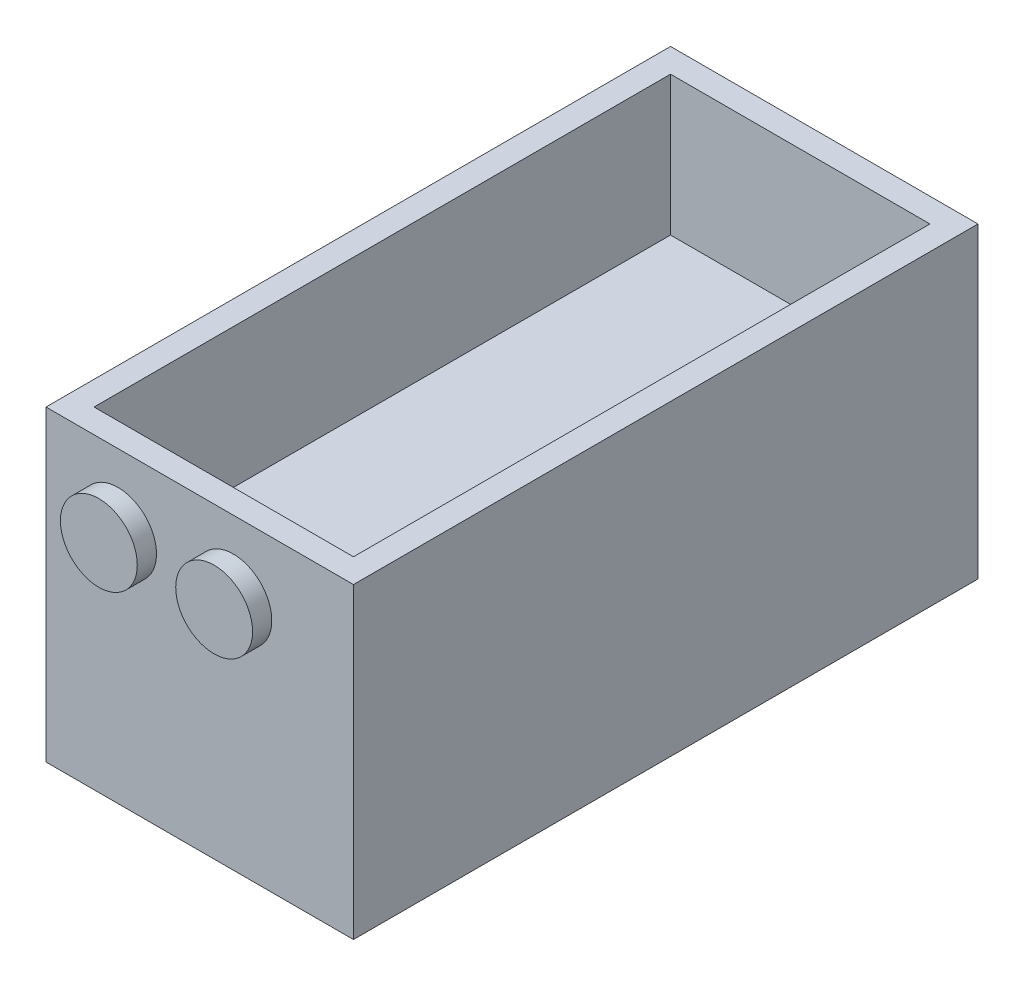
ISO-10303-21;
HEADER;
FILE_DESCRIPTION(('STEP AP214'),'2;1');
FILE_NAME('part.step','',(''),(''),'','','');
FILE_SCHEMA(('AUTOMOTIVE_DESIGN { 1 0 10303 214 1 1 1 1 }'));
ENDSEC;
DATA;
#1=APPLICATION_CONTEXT('core data for automotive mechanical design processes');
#2=APPLICATION_PROTOCOL_DEFINITION('international standard','automotive_design',2000,#1);
#3=PRODUCT_CONTEXT('',#1,'mechanical');
#4=PRODUCT('Part','Part','',(#3));
#5=PRODUCT_RELATED_PRODUCT_CATEGORY('part','',(#4));
#6=PRODUCT_DEFINITION_FORMATION('','',#4);
#7=PRODUCT_DEFINITION_CONTEXT('part definition',#1,'design');
#8=PRODUCT_DEFINITION('design','',#6,#7);
#9=PRODUCT_DEFINITION_SHAPE('','',#8);
#10=(LENGTH_UNIT() NAMED_UNIT(*) SI_UNIT(.MILLI.,.METRE.));
#11=(NAMED_UNIT(*) PLANE_ANGLE_UNIT() SI_UNIT($,.RADIAN.));
#12=(NAMED_UNIT(*) SI_UNIT($,.STERADIAN.) SOLID_ANGLE_UNIT());
#13=UNCERTAINTY_MEASURE_WITH_UNIT(LENGTH_MEASURE(1.E-05),#10,'distance_accuracy_value','');
#14=(GEOMETRIC_REPRESENTATION_CONTEXT(3) GLOBAL_UNCERTAINTY_ASSIGNED_CONTEXT((#13)) GLOBAL_UNIT_ASSIGNED_CONTEXT((#10,
#11,#12)) REPRESENTATION_CONTEXT('',''));
#15=CARTESIAN_POINT('',(0.,0.,0.));
#16=DIRECTION('',(0.,0.,1.));
#17=DIRECTION('',(1.,0.,0.));
#18=AXIS2_PLACEMENT_3D('',#15,#16,#17);
#19=CARTESIAN_POINT('',(0.,32.,0.));
#20=DIRECTION('',(1.,0.,0.));
#21=DIRECTION('',(0.,0.,-1.));
#22=AXIS2_PLACEMENT_3D('',#19,#20,#21);
#23=PLANE('',#22);
#24=DIRECTION('',(0.,0.,1.));
#25=VECTOR('',#24,1.);
#26=CARTESIAN_POINT('',(0.,0.,0.));
#27=LINE('',#26,#25);
#28=CARTESIAN_POINT('',(0.,0.,0.));
#29=VERTEX_POINT('',#28);
#30=CARTESIAN_POINT('',(0.,0.,65.));
#31=VERTEX_POINT('',#30);
#32=EDGE_CURVE('E171',#29,#31,#27,.T.);
#33=ORIENTED_EDGE('',*,*,#32,.T.);
#34=DIRECTION('',(0.,-1.,0.));
#35=VECTOR('',#34,1.);
#36=CARTESIAN_POINT('',(0.,32.,65.));
#37=LINE('',#36,#35);
#38=CARTESIAN_POINT('',(0.,32.,65.));
#39=VERTEX_POINT('',#38);
#40=EDGE_CURVE('E218',#39,#31,#37,.T.);
#41=ORIENTED_EDGE('',*,*,#40,.F.);
#42=DIRECTION('',(0.,0.,1.));
#43=VECTOR('',#42,1.);
#44=CARTESIAN_POINT('',(0.,32.,0.));
#45=LINE('',#44,#43);
#46=CARTESIAN_POINT('',(0.,32.,0.));
#47=VERTEX_POINT('',#46);
#48=EDGE_CURVE('E192',#47,#39,#45,.T.);
#49=ORIENTED_EDGE('',*,*,#48,.F.);
#50=DIRECTION('',(0.,-1.,0.));
#51=VECTOR('',#50,1.);
#52=CARTESIAN_POINT('',(0.,32.,0.));
#53=LINE('',#52,#51);
#54=EDGE_CURVE('E202',#47,#29,#53,.T.);
#55=ORIENTED_EDGE('',*,*,#54,.T.);
#56=EDGE_LOOP('',(#33,#41,#49,#55));
#57=FACE_BOUND('',#56,.T.);
#58=ADVANCED_FACE('F35',(#57),#23,.F.);
#59=CARTESIAN_POINT('',(0.,32.,65.));
#60=DIRECTION('',(0.,0.,-1.));
#61=DIRECTION('',(-1.,0.,0.));
#62=AXIS2_PLACEMENT_3D('',#59,#60,#61);
#63=PLANE('',#62);
#64=CARTESIAN_POINT('',(19.5,24.5,65.));
#65=DIRECTION('',(0.,0.,-1.));
#66=DIRECTION('',(-1.,0.,0.));
#67=AXIS2_PLACEMENT_3D('',#64,#65,#66);
#68=CIRCLE('',#67,4.);
#69=CARTESIAN_POINT('',(15.5,24.5,65.));
#70=VERTEX_POINT('',#69);
#71=EDGE_CURVE('E11',#70,#70,#68,.F.);
#72=ORIENTED_EDGE('',*,*,#71,.F.);
#73=EDGE_LOOP('',(#72));
#74=FACE_BOUND('',#73,.T.);
#75=CARTESIAN_POINT('',(7.50000000000002,24.5,65.));
#76=DIRECTION('',(0.,0.,-1.));
#77=DIRECTION('',(-1.,0.,0.));
#78=AXIS2_PLACEMENT_3D('',#75,#76,#77);
#79=CIRCLE('',#78,4.);
#80=CARTESIAN_POINT('',(3.50000000000002,24.5,65.));
#81=VERTEX_POINT('',#80);
#82=EDGE_CURVE('E42',#81,#81,#79,.F.);
#83=ORIENTED_EDGE('',*,*,#82,.F.);
#84=EDGE_LOOP('',(#83));
#85=FACE_BOUND('',#84,.T.);
#86=DIRECTION('',(1.,0.,0.));
#87=VECTOR('',#86,1.);
#88=CARTESIAN_POINT('',(0.,0.,65.));
#89=LINE('',#88,#87);
#90=CARTESIAN_POINT('',(32.,0.,65.));
#91=VERTEX_POINT('',#90);
#92=EDGE_CURVE('E205',#31,#91,#89,.T.);
#93=ORIENTED_EDGE('',*,*,#92,.T.);
#94=DIRECTION('',(0.,-1.,0.));
#95=VECTOR('',#94,1.);
#96=CARTESIAN_POINT('',(32.,32.,65.));
#97=LINE('',#96,#95);
#98=CARTESIAN_POINT('',(32.,32.,65.));
#99=VERTEX_POINT('',#98);
#100=EDGE_CURVE('E215',#99,#91,#97,.T.);
#101=ORIENTED_EDGE('',*,*,#100,.F.);
#102=DIRECTION('',(1.,0.,0.));
#103=VECTOR('',#102,1.);
#104=CARTESIAN_POINT('',(0.,32.,65.));
#105=LINE('',#104,#103);
#106=EDGE_CURVE('E195',#39,#99,#105,.T.);
#107=ORIENTED_EDGE('',*,*,#106,.F.);
#108=ORIENTED_EDGE('',*,*,#40,.T.);
#109=EDGE_LOOP('',(#93,#101,#107,#108));
#110=FACE_BOUND('',#109,.T.);
#111=ADVANCED_FACE('F225',(#74,#85,#110),#63,.F.);
#112=CARTESIAN_POINT('',(32.,32.,0.));
#113=DIRECTION('',(-1.,0.,0.));
#114=DIRECTION('',(0.,0.,1.));
#115=AXIS2_PLACEMENT_3D('',#112,#113,#114);
#116=PLANE('',#115);
#117=DIRECTION('',(0.,0.,-1.));
#118=VECTOR('',#117,1.);
#119=CARTESIAN_POINT('',(32.,0.,0.));
#120=LINE('',#119,#118);
#121=CARTESIAN_POINT('',(32.,0.,0.));
#122=VERTEX_POINT('',#121);
#123=EDGE_CURVE('E207',#91,#122,#120,.T.);
#124=ORIENTED_EDGE('',*,*,#123,.T.);
#125=DIRECTION('',(0.,-1.,0.));
#126=VECTOR('',#125,1.);
#127=CARTESIAN_POINT('',(32.,32.,0.));
#128=LINE('',#127,#126);
#129=CARTESIAN_POINT('',(32.,32.,0.));
#130=VERTEX_POINT('',#129);
#131=EDGE_CURVE('E212',#130,#122,#128,.T.);
#132=ORIENTED_EDGE('',*,*,#131,.F.);
#133=DIRECTION('',(0.,0.,-1.));
#134=VECTOR('',#133,1.);
#135=CARTESIAN_POINT('',(32.,32.,0.));
#136=LINE('',#135,#134);
#137=EDGE_CURVE('E198',#99,#130,#136,.T.);
#138=ORIENTED_EDGE('',*,*,#137,.F.);
#139=ORIENTED_EDGE('',*,*,#100,.T.);
#140=EDGE_LOOP('',(#124,#132,#138,#139));
#141=FACE_BOUND('',#140,.T.);
#142=ADVANCED_FACE('F228',(#141),#116,.F.);
#143=CARTESIAN_POINT('',(0.,32.,0.));
#144=DIRECTION('',(0.,0.,1.));
#145=DIRECTION('',(1.,0.,0.));
#146=AXIS2_PLACEMENT_3D('',#143,#144,#145);
#147=PLANE('',#146);
#148=DIRECTION('',(-1.,0.,0.));
#149=VECTOR('',#148,1.);
#150=CARTESIAN_POINT('',(0.,0.,0.));
#151=LINE('',#150,#149);
#152=EDGE_CURVE('E196',#122,#29,#151,.T.);
#153=ORIENTED_EDGE('',*,*,#152,.T.);
#154=ORIENTED_EDGE('',*,*,#54,.F.);
#155=DIRECTION('',(-1.,0.,0.));
#156=VECTOR('',#155,1.);
#157=CARTESIAN_POINT('',(0.,32.,0.));
#158=LINE('',#157,#156);
#159=EDGE_CURVE('E200',#130,#47,#158,.T.);
#160=ORIENTED_EDGE('',*,*,#159,.F.);
#161=ORIENTED_EDGE('',*,*,#131,.T.);
#162=EDGE_LOOP('',(#153,#154,#160,#161));
#163=FACE_BOUND('',#162,.T.);
#164=ADVANCED_FACE('F240',(#163),#147,.F.);
#165=CARTESIAN_POINT('',(0.,32.,0.));
#166=DIRECTION('',(0.,1.,0.));
#167=DIRECTION('',(0.,0.,1.));
#168=AXIS2_PLACEMENT_3D('',#165,#166,#167);
#169=PLANE('',#168);
#170=DIRECTION('',(0.,0.,1.));
#171=VECTOR('',#170,1.);
#172=CARTESIAN_POINT('',(2.5,32.,0.));
#173=LINE('',#172,#171);
#174=CARTESIAN_POINT('',(2.5,32.,2.5));
#175=VERTEX_POINT('',#174);
#176=CARTESIAN_POINT('',(2.50000000000002,32.,62.5));
#177=VERTEX_POINT('',#176);
#178=EDGE_CURVE('E185',#175,#177,#173,.T.);
#179=ORIENTED_EDGE('',*,*,#178,.F.);
#180=DIRECTION('',(-1.,0.,0.));
#181=VECTOR('',#180,1.);
#182=CARTESIAN_POINT('',(0.,32.,2.5));
#183=LINE('',#182,#181);
#184=CARTESIAN_POINT('',(29.5,32.,2.5));
#185=VERTEX_POINT('',#184);
#186=EDGE_CURVE('E176',#185,#175,#183,.T.);
#187=ORIENTED_EDGE('',*,*,#186,.F.);
#188=DIRECTION('',(0.,0.,-1.));
#189=VECTOR('',#188,1.);
#190=CARTESIAN_POINT('',(29.5,32.,0.));
#191=LINE('',#190,#189);
#192=CARTESIAN_POINT('',(29.5,32.,62.5));
#193=VERTEX_POINT('',#192);
#194=EDGE_CURVE('E189',#193,#185,#191,.T.);
#195=ORIENTED_EDGE('',*,*,#194,.F.);
#196=DIRECTION('',(1.,0.,0.));
#197=VECTOR('',#196,1.);
#198=CARTESIAN_POINT('',(0.,32.,62.5));
#199=LINE('',#198,#197);
#200=EDGE_CURVE('E187',#177,#193,#199,.T.);
#201=ORIENTED_EDGE('',*,*,#200,.F.);
#202=EDGE_LOOP('',(#179,#187,#195,#201));
#203=FACE_BOUND('',#202,.T.);
#204=ORIENTED_EDGE('',*,*,#48,.T.);
#205=ORIENTED_EDGE('',*,*,#106,.T.);
#206=ORIENTED_EDGE('',*,*,#137,.T.);
#207=ORIENTED_EDGE('',*,*,#159,.T.);
#208=EDGE_LOOP('',(#204,#205,#206,#207));
#209=FACE_BOUND('',#208,.T.);
#210=ADVANCED_FACE('F245',(#203,#209),#169,.T.);
#211=CARTESIAN_POINT('',(0.,0.,0.));
#212=DIRECTION('',(0.,1.,0.));
#213=DIRECTION('',(0.,0.,1.));
#214=AXIS2_PLACEMENT_3D('',#211,#212,#213);
#215=PLANE('',#214);
#216=DIRECTION('',(-1.,0.,0.));
#217=VECTOR('',#216,1.);
#218=CARTESIAN_POINT('',(0.,0.,2.5));
#219=LINE('',#218,#217);
#220=CARTESIAN_POINT('',(29.5,0.,2.5));
#221=VERTEX_POINT('',#220);
#222=CARTESIAN_POINT('',(2.5,0.,2.5));
#223=VERTEX_POINT('',#222);
#224=EDGE_CURVE('E130',#221,#223,#219,.T.);
#225=ORIENTED_EDGE('',*,*,#224,.T.);
#226=DIRECTION('',(0.,0.,1.));
#227=VECTOR('',#226,1.);
#228=CARTESIAN_POINT('',(2.5,0.,0.));
#229=LINE('',#228,#227);
#230=CARTESIAN_POINT('',(2.50000000000002,0.,62.5));
#231=VERTEX_POINT('',#230);
#232=EDGE_CURVE('E138',#223,#231,#229,.T.);
#233=ORIENTED_EDGE('',*,*,#232,.T.);
#234=DIRECTION('',(1.,0.,0.));
#235=VECTOR('',#234,1.);
#236=CARTESIAN_POINT('',(0.,0.,62.5));
#237=LINE('',#236,#235);
#238=CARTESIAN_POINT('',(29.5,0.,62.5));
#239=VERTEX_POINT('',#238);
#240=EDGE_CURVE('E145',#231,#239,#237,.T.);
#241=ORIENTED_EDGE('',*,*,#240,.T.);
#242=DIRECTION('',(0.,0.,-1.));
#243=VECTOR('',#242,1.);
#244=CARTESIAN_POINT('',(29.5,0.,0.));
#245=LINE('',#244,#243);
#246=EDGE_CURVE('E49',#239,#221,#245,.T.);
#247=ORIENTED_EDGE('',*,*,#246,.T.);
#248=EDGE_LOOP('',(#225,#233,#241,#247));
#249=FACE_BOUND('',#248,.T.);
#250=ORIENTED_EDGE('',*,*,#32,.F.);
#251=ORIENTED_EDGE('',*,*,#152,.F.);
#252=ORIENTED_EDGE('',*,*,#123,.F.);
#253=ORIENTED_EDGE('',*,*,#92,.F.);
#254=EDGE_LOOP('',(#250,#251,#252,#253));
#255=FACE_BOUND('',#254,.T.);
#256=ADVANCED_FACE('F148',(#249,#255),#215,.F.);
#257=CARTESIAN_POINT('',(2.5,32.,0.));
#258=DIRECTION('',(1.,0.,0.));
#259=DIRECTION('',(0.,0.,-1.));
#260=AXIS2_PLACEMENT_3D('',#257,#258,#259);
#261=PLANE('',#260);
#262=DIRECTION('',(0.,0.,1.));
#263=VECTOR('',#262,1.);
#264=CARTESIAN_POINT('',(2.5,17.5,0.));
#265=LINE('',#264,#263);
#266=CARTESIAN_POINT('',(2.5,17.5,2.5));
#267=VERTEX_POINT('',#266);
#268=CARTESIAN_POINT('',(2.50000000000002,17.5,62.5));
#269=VERTEX_POINT('',#268);
#270=EDGE_CURVE('E164',#267,#269,#265,.T.);
#271=ORIENTED_EDGE('',*,*,#270,.F.);
#272=DIRECTION('',(0.,-1.,0.));
#273=VECTOR('',#272,1.);
#274=CARTESIAN_POINT('',(2.5,32.,2.5));
#275=LINE('',#274,#273);
#276=EDGE_CURVE('E173',#175,#267,#275,.T.);
#277=ORIENTED_EDGE('',*,*,#276,.F.);
#278=ORIENTED_EDGE('',*,*,#178,.T.);
#279=DIRECTION('',(0.,-1.,0.));
#280=VECTOR('',#279,1.);
#281=CARTESIAN_POINT('',(2.50000000000002,32.,62.5));
#282=LINE('',#281,#280);
#283=EDGE_CURVE('E168',#177,#269,#282,.T.);
#284=ORIENTED_EDGE('',*,*,#283,.T.);
#285=EDGE_LOOP('',(#271,#277,#278,#284));
#286=FACE_BOUND('',#285,.T.);
#287=ADVANCED_FACE('F253',(#286),#261,.T.);
#288=CARTESIAN_POINT('',(0.,32.,62.5));
#289=DIRECTION('',(0.,0.,-1.));
#290=DIRECTION('',(-1.,0.,0.));
#291=AXIS2_PLACEMENT_3D('',#288,#289,#290);
#292=PLANE('',#291);
#293=DIRECTION('',(1.,0.,0.));
#294=VECTOR('',#293,1.);
#295=CARTESIAN_POINT('',(0.,17.5,62.5));
#296=LINE('',#295,#294);
#297=CARTESIAN_POINT('',(29.5,17.5,62.5));
#298=VERTEX_POINT('',#297);
#299=EDGE_CURVE('E167',#269,#298,#296,.T.);
#300=ORIENTED_EDGE('',*,*,#299,.F.);
#301=ORIENTED_EDGE('',*,*,#283,.F.);
#302=ORIENTED_EDGE('',*,*,#200,.T.);
#303=DIRECTION('',(0.,-1.,0.));
#304=VECTOR('',#303,1.);
#305=CARTESIAN_POINT('',(29.5,32.,62.5));
#306=LINE('',#305,#304);
#307=EDGE_CURVE('E172',#193,#298,#306,.T.);
#308=ORIENTED_EDGE('',*,*,#307,.T.);
#309=EDGE_LOOP('',(#300,#301,#302,#308));
#310=FACE_BOUND('',#309,.T.);
#311=ADVANCED_FACE('F293',(#310),#292,.T.);
#312=CARTESIAN_POINT('',(29.5,32.,0.));
#313=DIRECTION('',(-1.,0.,0.));
#314=DIRECTION('',(0.,0.,1.));
#315=AXIS2_PLACEMENT_3D('',#312,#313,#314);
#316=PLANE('',#315);
#317=DIRECTION('',(0.,0.,-1.));
#318=VECTOR('',#317,1.);
#319=CARTESIAN_POINT('',(29.5,17.5,0.));
#320=LINE('',#319,#318);
#321=CARTESIAN_POINT('',(29.5,17.5,2.5));
#322=VERTEX_POINT('',#321);
#323=EDGE_CURVE('E178',#298,#322,#320,.T.);
#324=ORIENTED_EDGE('',*,*,#323,.F.);
#325=ORIENTED_EDGE('',*,*,#307,.F.);
#326=ORIENTED_EDGE('',*,*,#194,.T.);
#327=DIRECTION('',(0.,-1.,0.));
#328=VECTOR('',#327,1.);
#329=CARTESIAN_POINT('',(29.5,32.,2.5));
#330=LINE('',#329,#328);
#331=EDGE_CURVE('E57',#185,#322,#330,.T.);
#332=ORIENTED_EDGE('',*,*,#331,.T.);
#333=EDGE_LOOP('',(#324,#325,#326,#332));
#334=FACE_BOUND('',#333,.T.);
#335=ADVANCED_FACE('F305',(#334),#316,.T.);
#336=CARTESIAN_POINT('',(0.,32.,2.5));
#337=DIRECTION('',(0.,0.,1.));
#338=DIRECTION('',(1.,0.,0.));
#339=AXIS2_PLACEMENT_3D('',#336,#337,#338);
#340=PLANE('',#339);
#341=DIRECTION('',(-1.,0.,0.));
#342=VECTOR('',#341,1.);
#343=CARTESIAN_POINT('',(0.,17.5,2.5));
#344=LINE('',#343,#342);
#345=EDGE_CURVE('E182',#322,#267,#344,.T.);
#346=ORIENTED_EDGE('',*,*,#345,.F.);
#347=ORIENTED_EDGE('',*,*,#331,.F.);
#348=ORIENTED_EDGE('',*,*,#186,.T.);
#349=ORIENTED_EDGE('',*,*,#276,.T.);
#350=EDGE_LOOP('',(#346,#347,#348,#349));
#351=FACE_BOUND('',#350,.T.);
#352=ADVANCED_FACE('F315',(#351),#340,.T.);
#353=CARTESIAN_POINT('',(0.,17.5,0.));
#354=DIRECTION('',(0.,1.,0.));
#355=DIRECTION('',(0.,0.,1.));
#356=AXIS2_PLACEMENT_3D('',#353,#354,#355);
#357=PLANE('',#356);
#358=ORIENTED_EDGE('',*,*,#270,.T.);
#359=ORIENTED_EDGE('',*,*,#299,.T.);
#360=ORIENTED_EDGE('',*,*,#323,.T.);
#361=ORIENTED_EDGE('',*,*,#345,.T.);
#362=EDGE_LOOP('',(#358,#359,#360,#361));
#363=FACE_BOUND('',#362,.T.);
#364=ADVANCED_FACE('F325',(#363),#357,.T.);
#365=CARTESIAN_POINT('',(0.,15.,0.));
#366=DIRECTION('',(0.,1.,0.));
#367=DIRECTION('',(0.,0.,1.));
#368=AXIS2_PLACEMENT_3D('',#365,#366,#367);
#369=PLANE('',#368);
#370=DIRECTION('',(0.,0.,-1.));
#371=VECTOR('',#370,1.);
#372=CARTESIAN_POINT('',(29.5,15.,0.));
#373=LINE('',#372,#371);
#374=CARTESIAN_POINT('',(29.5,15.,62.5));
#375=VERTEX_POINT('',#374);
#376=CARTESIAN_POINT('',(29.5,15.,2.5));
#377=VERTEX_POINT('',#376);
#378=EDGE_CURVE('E160',#375,#377,#373,.T.);
#379=ORIENTED_EDGE('',*,*,#378,.F.);
#380=DIRECTION('',(1.,0.,0.));
#381=VECTOR('',#380,1.);
#382=CARTESIAN_POINT('',(0.,15.,62.5));
#383=LINE('',#382,#381);
#384=CARTESIAN_POINT('',(2.50000000000002,15.,62.5));
#385=VERTEX_POINT('',#384);
#386=EDGE_CURVE('E157',#385,#375,#383,.T.);
#387=ORIENTED_EDGE('',*,*,#386,.F.);
#388=DIRECTION('',(0.,0.,1.));
#389=VECTOR('',#388,1.);
#390=CARTESIAN_POINT('',(2.5,15.,0.));
#391=LINE('',#390,#389);
#392=CARTESIAN_POINT('',(2.5,15.,2.5));
#393=VERTEX_POINT('',#392);
#394=EDGE_CURVE('E155',#393,#385,#391,.T.);
#395=ORIENTED_EDGE('',*,*,#394,.F.);
#396=DIRECTION('',(-1.,0.,0.));
#397=VECTOR('',#396,1.);
#398=CARTESIAN_POINT('',(0.,15.,2.5));
#399=LINE('',#398,#397);
#400=EDGE_CURVE('E131',#377,#393,#399,.T.);
#401=ORIENTED_EDGE('',*,*,#400,.F.);
#402=EDGE_LOOP('',(#379,#387,#395,#401));
#403=FACE_BOUND('',#402,.T.);
#404=ADVANCED_FACE('F334',(#403),#369,.F.);
#405=CARTESIAN_POINT('',(2.5,32.,0.));
#406=DIRECTION('',(1.,0.,0.));
#407=DIRECTION('',(0.,0.,-1.));
#408=AXIS2_PLACEMENT_3D('',#405,#406,#407);
#409=PLANE('',#408);
#410=ORIENTED_EDGE('',*,*,#394,.T.);
#411=DIRECTION('',(0.,-1.,0.));
#412=VECTOR('',#411,1.);
#413=CARTESIAN_POINT('',(2.50000000000002,32.,62.5));
#414=LINE('',#413,#412);
#415=EDGE_CURVE('E141',#385,#231,#414,.T.);
#416=ORIENTED_EDGE('',*,*,#415,.T.);
#417=ORIENTED_EDGE('',*,*,#232,.F.);
#418=DIRECTION('',(0.,-1.,0.));
#419=VECTOR('',#418,1.);
#420=CARTESIAN_POINT('',(2.5,32.,2.5));
#421=LINE('',#420,#419);
#422=EDGE_CURVE('E125',#393,#223,#421,.T.);
#423=ORIENTED_EDGE('',*,*,#422,.F.);
#424=EDGE_LOOP('',(#410,#416,#417,#423));
#425=FACE_BOUND('',#424,.T.);
#426=ADVANCED_FACE('F139',(#425),#409,.T.);
#427=CARTESIAN_POINT('',(0.,32.,62.5));
#428=DIRECTION('',(0.,0.,-1.));
#429=DIRECTION('',(-1.,0.,0.));
#430=AXIS2_PLACEMENT_3D('',#427,#428,#429);
#431=PLANE('',#430);
#432=ORIENTED_EDGE('',*,*,#386,.T.);
#433=DIRECTION('',(0.,-1.,0.));
#434=VECTOR('',#433,1.);
#435=CARTESIAN_POINT('',(29.5,32.,62.5));
#436=LINE('',#435,#434);
#437=EDGE_CURVE('E435',#375,#239,#436,.T.);
#438=ORIENTED_EDGE('',*,*,#437,.T.);
#439=ORIENTED_EDGE('',*,*,#240,.F.);
#440=ORIENTED_EDGE('',*,*,#415,.F.);
#441=EDGE_LOOP('',(#432,#438,#439,#440));
#442=FACE_BOUND('',#441,.T.);
#443=ADVANCED_FACE('F361',(#442),#431,.T.);
#444=CARTESIAN_POINT('',(29.5,32.,0.));
#445=DIRECTION('',(-1.,0.,0.));
#446=DIRECTION('',(0.,0.,1.));
#447=AXIS2_PLACEMENT_3D('',#444,#445,#446);
#448=PLANE('',#447);
#449=ORIENTED_EDGE('',*,*,#378,.T.);
#450=DIRECTION('',(0.,-1.,0.));
#451=VECTOR('',#450,1.);
#452=CARTESIAN_POINT('',(29.5,32.,2.5));
#453=LINE('',#452,#451);
#454=EDGE_CURVE('E135',#377,#221,#453,.T.);
#455=ORIENTED_EDGE('',*,*,#454,.T.);
#456=ORIENTED_EDGE('',*,*,#246,.F.);
#457=ORIENTED_EDGE('',*,*,#437,.F.);
#458=EDGE_LOOP('',(#449,#455,#456,#457));
#459=FACE_BOUND('',#458,.T.);
#460=ADVANCED_FACE('F370',(#459),#448,.T.);
#461=CARTESIAN_POINT('',(0.,32.,2.5));
#462=DIRECTION('',(0.,0.,1.));
#463=DIRECTION('',(1.,0.,0.));
#464=AXIS2_PLACEMENT_3D('',#461,#462,#463);
#465=PLANE('',#464);
#466=ORIENTED_EDGE('',*,*,#400,.T.);
#467=ORIENTED_EDGE('',*,*,#422,.T.);
#468=ORIENTED_EDGE('',*,*,#224,.F.);
#469=ORIENTED_EDGE('',*,*,#454,.F.);
#470=EDGE_LOOP('',(#466,#467,#468,#469));
#471=FACE_BOUND('',#470,.T.);
#472=ADVANCED_FACE('F127',(#471),#465,.T.);
#473=CARTESIAN_POINT('',(7.50000000000002,24.5,67.));
#474=DIRECTION('',(0.,0.,-1.));
#475=DIRECTION('',(-1.,0.,0.));
#476=AXIS2_PLACEMENT_3D('',#473,#474,#475);
#477=CYLINDRICAL_SURFACE('',#476,4.);
#478=CARTESIAN_POINT('',(7.50000000000002,24.5,67.));
#479=DIRECTION('',(0.,0.,1.));
#480=DIRECTION('',(1.,0.,0.));
#481=AXIS2_PLACEMENT_3D('',#478,#479,#480);
#482=CIRCLE('',#481,4.);
#483=CARTESIAN_POINT('',(11.5,24.5,67.));
#484=VERTEX_POINT('',#483);
#485=EDGE_CURVE('E146',#484,#484,#482,.T.);
#486=ORIENTED_EDGE('',*,*,#485,.F.);
#487=EDGE_LOOP('',(#486));
#488=FACE_BOUND('',#487,.T.);
#489=ORIENTED_EDGE('',*,*,#82,.T.);
#490=EDGE_LOOP('',(#489));
#491=FACE_BOUND('',#490,.T.);
#492=ADVANCED_FACE('F223',(#488,#491),#477,.T.);
#493=CARTESIAN_POINT('',(7.50000000000002,24.5,67.));
#494=DIRECTION('',(0.,0.,1.));
#495=DIRECTION('',(1.,0.,0.));
#496=AXIS2_PLACEMENT_3D('',#493,#494,#495);
#497=PLANE('',#496);
#498=ORIENTED_EDGE('',*,*,#485,.T.);
#499=EDGE_LOOP('',(#498));
#500=FACE_BOUND('',#499,.T.);
#501=ADVANCED_FACE('F394',(#500),#497,.T.);
#502=CARTESIAN_POINT('',(19.5,24.5,67.));
#503=DIRECTION('',(0.,0.,-1.));
#504=DIRECTION('',(-1.,0.,0.));
#505=AXIS2_PLACEMENT_3D('',#502,#503,#504);
#506=CYLINDRICAL_SURFACE('',#505,4.);
#507=CARTESIAN_POINT('',(19.5,24.5,67.));
#508=DIRECTION('',(0.,0.,1.));
#509=DIRECTION('',(1.,0.,0.));
#510=AXIS2_PLACEMENT_3D('',#507,#508,#509);
#511=CIRCLE('',#510,4.);
#512=CARTESIAN_POINT('',(23.5,24.5,67.));
#513=VERTEX_POINT('',#512);
#514=EDGE_CURVE('E430',#513,#513,#511,.T.);
#515=ORIENTED_EDGE('',*,*,#514,.F.);
#516=EDGE_LOOP('',(#515));
#517=FACE_BOUND('',#516,.T.);
#518=ORIENTED_EDGE('',*,*,#71,.T.);
#519=EDGE_LOOP('',(#518));
#520=FACE_BOUND('',#519,.T.);
#521=ADVANCED_FACE('F401',(#517,#520),#506,.T.);
#522=CARTESIAN_POINT('',(19.5,24.5,67.));
#523=DIRECTION('',(0.,0.,1.));
#524=DIRECTION('',(1.,0.,0.));
#525=AXIS2_PLACEMENT_3D('',#522,#523,#524);
#526=PLANE('',#525);
#527=ORIENTED_EDGE('',*,*,#514,.T.);
#528=EDGE_LOOP('',(#527));
#529=FACE_BOUND('',#528,.T.);
#530=ADVANCED_FACE('F409',(#529),#526,.T.);
#531=CLOSED_SHELL('',(#58,#111,#142,#164,#210,#256,#287,#311,#335,#352,#364,#404,#426,#443,#460,
#472,#492,#501,#521,#530));
#532=MANIFOLD_SOLID_BREP('B2',#531);
#533=ADVANCED_BREP_SHAPE_REPRESENTATION('',(#18,#532),#14);
#534=SHAPE_DEFINITION_REPRESENTATION(#9,#533);
ENDSEC;
END-ISO-10303-21;
